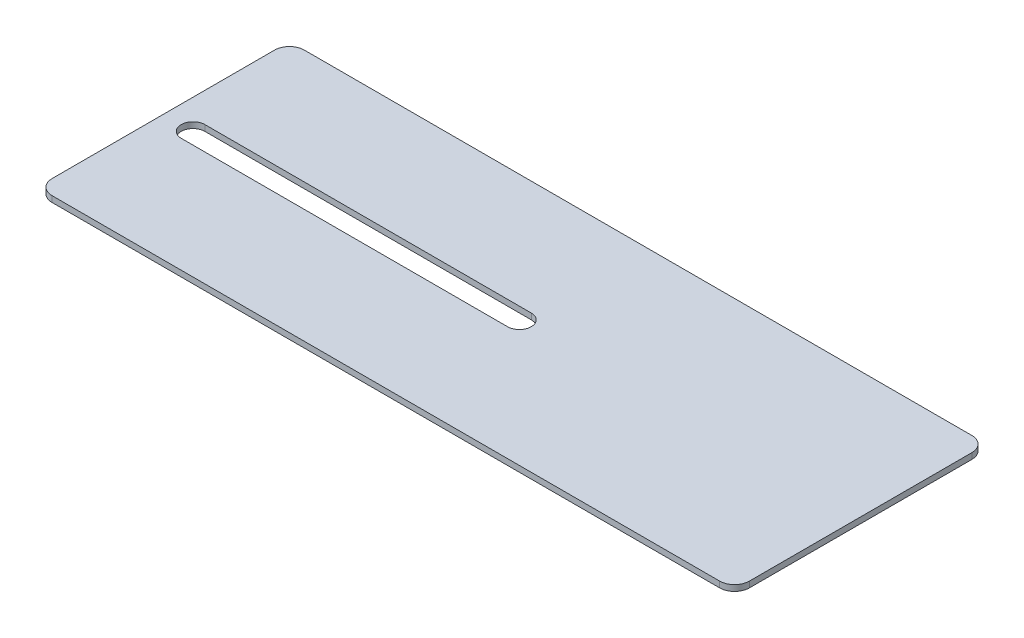
ISO-10303-21;
HEADER;
FILE_DESCRIPTION(('STEP AP214'),'2;1');
FILE_NAME('part.step','',(''),(''),'','','');
FILE_SCHEMA(('AUTOMOTIVE_DESIGN { 1 0 10303 214 1 1 1 1 }'));
ENDSEC;
DATA;
#1=APPLICATION_CONTEXT('core data for automotive mechanical design processes');
#2=APPLICATION_PROTOCOL_DEFINITION('international standard','automotive_design',2000,#1);
#3=PRODUCT_CONTEXT('',#1,'mechanical');
#4=PRODUCT('Part','Part','',(#3));
#5=PRODUCT_RELATED_PRODUCT_CATEGORY('part','',(#4));
#6=PRODUCT_DEFINITION_FORMATION('','',#4);
#7=PRODUCT_DEFINITION_CONTEXT('part definition',#1,'design');
#8=PRODUCT_DEFINITION('design','',#6,#7);
#9=PRODUCT_DEFINITION_SHAPE('','',#8);
#10=(LENGTH_UNIT() NAMED_UNIT(*) SI_UNIT(.MILLI.,.METRE.));
#11=(NAMED_UNIT(*) PLANE_ANGLE_UNIT() SI_UNIT($,.RADIAN.));
#12=(NAMED_UNIT(*) SI_UNIT($,.STERADIAN.) SOLID_ANGLE_UNIT());
#13=UNCERTAINTY_MEASURE_WITH_UNIT(LENGTH_MEASURE(1.E-05),#10,'distance_accuracy_value','');
#14=(GEOMETRIC_REPRESENTATION_CONTEXT(3) GLOBAL_UNCERTAINTY_ASSIGNED_CONTEXT((#13)) GLOBAL_UNIT_ASSIGNED_CONTEXT((#10,
#11,#12)) REPRESENTATION_CONTEXT('',''));
#15=CARTESIAN_POINT('',(0.,0.,0.));
#16=DIRECTION('',(0.,0.,1.));
#17=DIRECTION('',(1.,0.,0.));
#18=AXIS2_PLACEMENT_3D('',#15,#16,#17);
#19=CARTESIAN_POINT('',(117.5,0.,42.5));
#20=DIRECTION('',(1.,0.,0.));
#21=DIRECTION('',(0.,0.,-1.));
#22=AXIS2_PLACEMENT_3D('',#19,#20,#21);
#23=PLANE('',#22);
#24=DIRECTION('',(0.,1.,0.));
#25=VECTOR('',#24,1.);
#26=CARTESIAN_POINT('',(117.5,0.,37.5));
#27=LINE('',#26,#25);
#28=CARTESIAN_POINT('',(117.5,-2.,37.5));
#29=VERTEX_POINT('',#28);
#30=CARTESIAN_POINT('',(117.5,0.,37.5));
#31=VERTEX_POINT('',#30);
#32=EDGE_CURVE('E11',#29,#31,#27,.T.);
#33=ORIENTED_EDGE('',*,*,#32,.F.);
#34=DIRECTION('',(0.,0.,1.));
#35=VECTOR('',#34,1.);
#36=CARTESIAN_POINT('',(117.5,-2.,0.));
#37=LINE('',#36,#35);
#38=CARTESIAN_POINT('',(117.5,-2.,-37.5));
#39=VERTEX_POINT('',#38);
#40=EDGE_CURVE('E117',#29,#39,#37,.F.);
#41=ORIENTED_EDGE('',*,*,#40,.T.);
#42=DIRECTION('',(0.,1.,0.));
#43=VECTOR('',#42,1.);
#44=CARTESIAN_POINT('',(117.5,0.,-37.5));
#45=LINE('',#44,#43);
#46=CARTESIAN_POINT('',(117.5,0.,-37.5));
#47=VERTEX_POINT('',#46);
#48=EDGE_CURVE('E47',#39,#47,#45,.T.);
#49=ORIENTED_EDGE('',*,*,#48,.T.);
#50=DIRECTION('',(0.,0.,-1.));
#51=VECTOR('',#50,1.);
#52=CARTESIAN_POINT('',(117.5,0.,42.5));
#53=LINE('',#52,#51);
#54=EDGE_CURVE('E173',#31,#47,#53,.T.);
#55=ORIENTED_EDGE('',*,*,#54,.F.);
#56=EDGE_LOOP('',(#33,#41,#49,#55));
#57=FACE_BOUND('',#56,.T.);
#58=ADVANCED_FACE('F37',(#57),#23,.T.);
#59=CARTESIAN_POINT('',(112.5,0.,-37.5));
#60=DIRECTION('',(0.,1.,0.));
#61=DIRECTION('',(0.,0.,1.));
#62=AXIS2_PLACEMENT_3D('',#59,#60,#61);
#63=CYLINDRICAL_SURFACE('',#62,5.);
#64=ORIENTED_EDGE('',*,*,#48,.F.);
#65=CARTESIAN_POINT('',(112.5,-2.,-37.5));
#66=DIRECTION('',(0.,1.,0.));
#67=DIRECTION('',(0.,0.,1.));
#68=AXIS2_PLACEMENT_3D('',#65,#66,#67);
#69=CIRCLE('',#68,5.);
#70=CARTESIAN_POINT('',(112.5,-2.,-42.5));
#71=VERTEX_POINT('',#70);
#72=EDGE_CURVE('E141',#39,#71,#69,.T.);
#73=ORIENTED_EDGE('',*,*,#72,.T.);
#74=DIRECTION('',(0.,1.,0.));
#75=VECTOR('',#74,1.);
#76=CARTESIAN_POINT('',(112.5,0.,-42.5));
#77=LINE('',#76,#75);
#78=CARTESIAN_POINT('',(112.5,0.,-42.5));
#79=VERTEX_POINT('',#78);
#80=EDGE_CURVE('E166',#71,#79,#77,.T.);
#81=ORIENTED_EDGE('',*,*,#80,.T.);
#82=CARTESIAN_POINT('',(112.5,0.,-37.5));
#83=DIRECTION('',(0.,1.,0.));
#84=DIRECTION('',(0.,0.,1.));
#85=AXIS2_PLACEMENT_3D('',#82,#83,#84);
#86=CIRCLE('',#85,5.);
#87=EDGE_CURVE('E182',#47,#79,#86,.T.);
#88=ORIENTED_EDGE('',*,*,#87,.F.);
#89=EDGE_LOOP('',(#64,#73,#81,#88));
#90=FACE_BOUND('',#89,.T.);
#91=ADVANCED_FACE('F185',(#90),#63,.T.);
#92=CARTESIAN_POINT('',(117.5,0.,-42.5));
#93=DIRECTION('',(0.,0.,-1.));
#94=DIRECTION('',(-1.,0.,0.));
#95=AXIS2_PLACEMENT_3D('',#92,#93,#94);
#96=PLANE('',#95);
#97=ORIENTED_EDGE('',*,*,#80,.F.);
#98=DIRECTION('',(1.,0.,0.));
#99=VECTOR('',#98,1.);
#100=CARTESIAN_POINT('',(0.,-2.,-42.5));
#101=LINE('',#100,#99);
#102=CARTESIAN_POINT('',(-112.5,-2.,-42.5));
#103=VERTEX_POINT('',#102);
#104=EDGE_CURVE('E138',#71,#103,#101,.F.);
#105=ORIENTED_EDGE('',*,*,#104,.T.);
#106=DIRECTION('',(0.,1.,0.));
#107=VECTOR('',#106,1.);
#108=CARTESIAN_POINT('',(-112.5,0.,-42.5));
#109=LINE('',#108,#107);
#110=CARTESIAN_POINT('',(-112.5,0.,-42.5));
#111=VERTEX_POINT('',#110);
#112=EDGE_CURVE('E163',#103,#111,#109,.T.);
#113=ORIENTED_EDGE('',*,*,#112,.T.);
#114=DIRECTION('',(-1.,0.,0.));
#115=VECTOR('',#114,1.);
#116=CARTESIAN_POINT('',(117.5,0.,-42.5));
#117=LINE('',#116,#115);
#118=EDGE_CURVE('E186',#79,#111,#117,.T.);
#119=ORIENTED_EDGE('',*,*,#118,.F.);
#120=EDGE_LOOP('',(#97,#105,#113,#119));
#121=FACE_BOUND('',#120,.T.);
#122=ADVANCED_FACE('F269',(#121),#96,.T.);
#123=CARTESIAN_POINT('',(-112.5,0.,-37.5));
#124=DIRECTION('',(0.,1.,0.));
#125=DIRECTION('',(0.,0.,1.));
#126=AXIS2_PLACEMENT_3D('',#123,#124,#125);
#127=CYLINDRICAL_SURFACE('',#126,5.);
#128=ORIENTED_EDGE('',*,*,#112,.F.);
#129=CARTESIAN_POINT('',(-112.5,-2.,-37.5));
#130=DIRECTION('',(0.,1.,0.));
#131=DIRECTION('',(0.,0.,1.));
#132=AXIS2_PLACEMENT_3D('',#129,#130,#131);
#133=CIRCLE('',#132,5.);
#134=CARTESIAN_POINT('',(-117.5,-2.,-37.5));
#135=VERTEX_POINT('',#134);
#136=EDGE_CURVE('E135',#103,#135,#133,.T.);
#137=ORIENTED_EDGE('',*,*,#136,.T.);
#138=DIRECTION('',(0.,1.,0.));
#139=VECTOR('',#138,1.);
#140=CARTESIAN_POINT('',(-117.5,0.,-37.5));
#141=LINE('',#140,#139);
#142=CARTESIAN_POINT('',(-117.5,0.,-37.5));
#143=VERTEX_POINT('',#142);
#144=EDGE_CURVE('E160',#135,#143,#141,.T.);
#145=ORIENTED_EDGE('',*,*,#144,.T.);
#146=CARTESIAN_POINT('',(-112.5,0.,-37.5));
#147=DIRECTION('',(0.,1.,0.));
#148=DIRECTION('',(0.,0.,1.));
#149=AXIS2_PLACEMENT_3D('',#146,#147,#148);
#150=CIRCLE('',#149,5.);
#151=EDGE_CURVE('E188',#111,#143,#150,.T.);
#152=ORIENTED_EDGE('',*,*,#151,.F.);
#153=EDGE_LOOP('',(#128,#137,#145,#152));
#154=FACE_BOUND('',#153,.T.);
#155=ADVANCED_FACE('F231',(#154),#127,.T.);
#156=CARTESIAN_POINT('',(-117.5,0.,42.5));
#157=DIRECTION('',(-1.,0.,0.));
#158=DIRECTION('',(0.,0.,1.));
#159=AXIS2_PLACEMENT_3D('',#156,#157,#158);
#160=PLANE('',#159);
#161=ORIENTED_EDGE('',*,*,#144,.F.);
#162=DIRECTION('',(0.,0.,1.));
#163=VECTOR('',#162,1.);
#164=CARTESIAN_POINT('',(-117.5,-2.,0.));
#165=LINE('',#164,#163);
#166=CARTESIAN_POINT('',(-117.5,-2.,37.5));
#167=VERTEX_POINT('',#166);
#168=EDGE_CURVE('E132',#135,#167,#165,.T.);
#169=ORIENTED_EDGE('',*,*,#168,.T.);
#170=DIRECTION('',(0.,1.,0.));
#171=VECTOR('',#170,1.);
#172=CARTESIAN_POINT('',(-117.5,0.,37.5));
#173=LINE('',#172,#171);
#174=CARTESIAN_POINT('',(-117.5,0.,37.5));
#175=VERTEX_POINT('',#174);
#176=EDGE_CURVE('E158',#167,#175,#173,.T.);
#177=ORIENTED_EDGE('',*,*,#176,.T.);
#178=DIRECTION('',(0.,0.,1.));
#179=VECTOR('',#178,1.);
#180=CARTESIAN_POINT('',(-117.5,0.,42.5));
#181=LINE('',#180,#179);
#182=EDGE_CURVE('E194',#143,#175,#181,.T.);
#183=ORIENTED_EDGE('',*,*,#182,.F.);
#184=EDGE_LOOP('',(#161,#169,#177,#183));
#185=FACE_BOUND('',#184,.T.);
#186=ADVANCED_FACE('F236',(#185),#160,.T.);
#187=CARTESIAN_POINT('',(-112.5,0.,37.5));
#188=DIRECTION('',(0.,1.,0.));
#189=DIRECTION('',(0.,0.,1.));
#190=AXIS2_PLACEMENT_3D('',#187,#188,#189);
#191=CYLINDRICAL_SURFACE('',#190,5.);
#192=ORIENTED_EDGE('',*,*,#176,.F.);
#193=CARTESIAN_POINT('',(-112.5,-2.,37.5));
#194=DIRECTION('',(0.,1.,0.));
#195=DIRECTION('',(0.,0.,1.));
#196=AXIS2_PLACEMENT_3D('',#193,#194,#195);
#197=CIRCLE('',#196,5.);
#198=CARTESIAN_POINT('',(-112.5,-2.,42.5));
#199=VERTEX_POINT('',#198);
#200=EDGE_CURVE('E129',#167,#199,#197,.T.);
#201=ORIENTED_EDGE('',*,*,#200,.T.);
#202=DIRECTION('',(0.,1.,0.));
#203=VECTOR('',#202,1.);
#204=CARTESIAN_POINT('',(-112.5,0.,42.5));
#205=LINE('',#204,#203);
#206=CARTESIAN_POINT('',(-112.5,0.,42.5));
#207=VERTEX_POINT('',#206);
#208=EDGE_CURVE('E55',#199,#207,#205,.T.);
#209=ORIENTED_EDGE('',*,*,#208,.T.);
#210=CARTESIAN_POINT('',(-112.5,0.,37.5));
#211=DIRECTION('',(0.,1.,0.));
#212=DIRECTION('',(0.,0.,1.));
#213=AXIS2_PLACEMENT_3D('',#210,#211,#212);
#214=CIRCLE('',#213,5.);
#215=EDGE_CURVE('E156',#175,#207,#214,.T.);
#216=ORIENTED_EDGE('',*,*,#215,.F.);
#217=EDGE_LOOP('',(#192,#201,#209,#216));
#218=FACE_BOUND('',#217,.T.);
#219=ADVANCED_FACE('F237',(#218),#191,.T.);
#220=CARTESIAN_POINT('',(117.5,0.,42.5));
#221=DIRECTION('',(0.,0.,1.));
#222=DIRECTION('',(1.,0.,0.));
#223=AXIS2_PLACEMENT_3D('',#220,#221,#222);
#224=PLANE('',#223);
#225=ORIENTED_EDGE('',*,*,#208,.F.);
#226=DIRECTION('',(1.,0.,0.));
#227=VECTOR('',#226,1.);
#228=CARTESIAN_POINT('',(0.,-2.,42.5));
#229=LINE('',#228,#227);
#230=CARTESIAN_POINT('',(112.5,-2.,42.5));
#231=VERTEX_POINT('',#230);
#232=EDGE_CURVE('E115',#199,#231,#229,.T.);
#233=ORIENTED_EDGE('',*,*,#232,.T.);
#234=DIRECTION('',(0.,1.,0.));
#235=VECTOR('',#234,1.);
#236=CARTESIAN_POINT('',(112.5,0.,42.5));
#237=LINE('',#236,#235);
#238=CARTESIAN_POINT('',(112.5,0.,42.5));
#239=VERTEX_POINT('',#238);
#240=EDGE_CURVE('E41',#231,#239,#237,.T.);
#241=ORIENTED_EDGE('',*,*,#240,.T.);
#242=DIRECTION('',(1.,0.,0.));
#243=VECTOR('',#242,1.);
#244=CARTESIAN_POINT('',(117.5,0.,42.5));
#245=LINE('',#244,#243);
#246=EDGE_CURVE('E238',#207,#239,#245,.T.);
#247=ORIENTED_EDGE('',*,*,#246,.F.);
#248=EDGE_LOOP('',(#225,#233,#241,#247));
#249=FACE_BOUND('',#248,.T.);
#250=ADVANCED_FACE('F119',(#249),#224,.T.);
#251=CARTESIAN_POINT('',(2.49999999999989,0.,0.));
#252=DIRECTION('',(0.,1.,0.));
#253=DIRECTION('',(0.,0.,1.));
#254=AXIS2_PLACEMENT_3D('',#251,#252,#253);
#255=CYLINDRICAL_SURFACE('',#254,4.);
#256=DIRECTION('',(0.,1.,0.));
#257=VECTOR('',#256,1.);
#258=CARTESIAN_POINT('',(2.49999999999989,0.,-4.));
#259=LINE('',#258,#257);
#260=CARTESIAN_POINT('',(2.49999999999989,-2.,-4.));
#261=VERTEX_POINT('',#260);
#262=CARTESIAN_POINT('',(2.49999999999989,0.,-4.));
#263=VERTEX_POINT('',#262);
#264=EDGE_CURVE('E110',#261,#263,#259,.T.);
#265=ORIENTED_EDGE('',*,*,#264,.F.);
#266=CARTESIAN_POINT('',(2.49999999999989,-2.,0.));
#267=DIRECTION('',(0.,1.,0.));
#268=DIRECTION('',(0.,0.,1.));
#269=AXIS2_PLACEMENT_3D('',#266,#267,#268);
#270=CIRCLE('',#269,4.);
#271=CARTESIAN_POINT('',(2.49999999999989,-2.,4.));
#272=VERTEX_POINT('',#271);
#273=EDGE_CURVE('E123',#272,#261,#270,.T.);
#274=ORIENTED_EDGE('',*,*,#273,.F.);
#275=DIRECTION('',(0.,1.,0.));
#276=VECTOR('',#275,1.);
#277=CARTESIAN_POINT('',(2.49999999999989,0.,4.));
#278=LINE('',#277,#276);
#279=CARTESIAN_POINT('',(2.49999999999989,0.,4.));
#280=VERTEX_POINT('',#279);
#281=EDGE_CURVE('E148',#272,#280,#278,.T.);
#282=ORIENTED_EDGE('',*,*,#281,.T.);
#283=CARTESIAN_POINT('',(2.49999999999989,0.,0.));
#284=DIRECTION('',(0.,1.,0.));
#285=DIRECTION('',(0.,0.,1.));
#286=AXIS2_PLACEMENT_3D('',#283,#284,#285);
#287=CIRCLE('',#286,4.);
#288=EDGE_CURVE('E240',#280,#263,#287,.T.);
#289=ORIENTED_EDGE('',*,*,#288,.T.);
#290=EDGE_LOOP('',(#265,#274,#282,#289));
#291=FACE_BOUND('',#290,.T.);
#292=ADVANCED_FACE('F254',(#291),#255,.F.);
#293=CARTESIAN_POINT('',(-107.5,0.,4.));
#294=DIRECTION('',(0.,0.,1.));
#295=DIRECTION('',(1.,0.,0.));
#296=AXIS2_PLACEMENT_3D('',#293,#294,#295);
#297=PLANE('',#296);
#298=ORIENTED_EDGE('',*,*,#281,.F.);
#299=DIRECTION('',(1.,0.,0.));
#300=VECTOR('',#299,1.);
#301=CARTESIAN_POINT('',(0.,-2.,4.));
#302=LINE('',#301,#300);
#303=CARTESIAN_POINT('',(-107.5,-2.,4.));
#304=VERTEX_POINT('',#303);
#305=EDGE_CURVE('E120',#304,#272,#302,.T.);
#306=ORIENTED_EDGE('',*,*,#305,.F.);
#307=DIRECTION('',(0.,1.,0.));
#308=VECTOR('',#307,1.);
#309=CARTESIAN_POINT('',(-107.5,0.,4.));
#310=LINE('',#309,#308);
#311=CARTESIAN_POINT('',(-107.5,0.,4.));
#312=VERTEX_POINT('',#311);
#313=EDGE_CURVE('E145',#304,#312,#310,.T.);
#314=ORIENTED_EDGE('',*,*,#313,.T.);
#315=DIRECTION('',(1.,0.,0.));
#316=VECTOR('',#315,1.);
#317=CARTESIAN_POINT('',(-107.5,0.,4.));
#318=LINE('',#317,#316);
#319=EDGE_CURVE('E219',#312,#280,#318,.T.);
#320=ORIENTED_EDGE('',*,*,#319,.T.);
#321=EDGE_LOOP('',(#298,#306,#314,#320));
#322=FACE_BOUND('',#321,.T.);
#323=ADVANCED_FACE('F217',(#322),#297,.F.);
#324=CARTESIAN_POINT('',(-107.5,0.,0.));
#325=DIRECTION('',(0.,1.,0.));
#326=DIRECTION('',(0.,0.,1.));
#327=AXIS2_PLACEMENT_3D('',#324,#325,#326);
#328=CYLINDRICAL_SURFACE('',#327,4.);
#329=ORIENTED_EDGE('',*,*,#313,.F.);
#330=CARTESIAN_POINT('',(-107.5,-2.,0.));
#331=DIRECTION('',(0.,1.,0.));
#332=DIRECTION('',(0.,0.,1.));
#333=AXIS2_PLACEMENT_3D('',#330,#331,#332);
#334=CIRCLE('',#333,4.);
#335=CARTESIAN_POINT('',(-107.5,-2.,-4.));
#336=VERTEX_POINT('',#335);
#337=EDGE_CURVE('E199',#336,#304,#334,.T.);
#338=ORIENTED_EDGE('',*,*,#337,.F.);
#339=DIRECTION('',(0.,1.,0.));
#340=VECTOR('',#339,1.);
#341=CARTESIAN_POINT('',(-107.5,0.,-4.));
#342=LINE('',#341,#340);
#343=CARTESIAN_POINT('',(-107.5,0.,-4.));
#344=VERTEX_POINT('',#343);
#345=EDGE_CURVE('E149',#336,#344,#342,.T.);
#346=ORIENTED_EDGE('',*,*,#345,.T.);
#347=CARTESIAN_POINT('',(-107.5,0.,0.));
#348=DIRECTION('',(0.,1.,0.));
#349=DIRECTION('',(0.,0.,1.));
#350=AXIS2_PLACEMENT_3D('',#347,#348,#349);
#351=CIRCLE('',#350,4.);
#352=EDGE_CURVE('E131',#344,#312,#351,.T.);
#353=ORIENTED_EDGE('',*,*,#352,.T.);
#354=EDGE_LOOP('',(#329,#338,#346,#353));
#355=FACE_BOUND('',#354,.T.);
#356=ADVANCED_FACE('F210',(#355),#328,.F.);
#357=CARTESIAN_POINT('',(-107.5,0.,-4.));
#358=DIRECTION('',(0.,0.,-1.));
#359=DIRECTION('',(-1.,0.,0.));
#360=AXIS2_PLACEMENT_3D('',#357,#358,#359);
#361=PLANE('',#360);
#362=DIRECTION('',(1.,0.,0.));
#363=VECTOR('',#362,1.);
#364=CARTESIAN_POINT('',(0.,-2.,-4.));
#365=LINE('',#364,#363);
#366=EDGE_CURVE('E127',#261,#336,#365,.F.);
#367=ORIENTED_EDGE('',*,*,#366,.F.);
#368=ORIENTED_EDGE('',*,*,#264,.T.);
#369=DIRECTION('',(-1.,0.,0.));
#370=VECTOR('',#369,1.);
#371=CARTESIAN_POINT('',(-107.5,0.,-4.));
#372=LINE('',#371,#370);
#373=EDGE_CURVE('E245',#263,#344,#372,.T.);
#374=ORIENTED_EDGE('',*,*,#373,.T.);
#375=ORIENTED_EDGE('',*,*,#345,.F.);
#376=EDGE_LOOP('',(#367,#368,#374,#375));
#377=FACE_BOUND('',#376,.T.);
#378=ADVANCED_FACE('F249',(#377),#361,.F.);
#379=CARTESIAN_POINT('',(112.5,0.,37.5));
#380=DIRECTION('',(0.,1.,0.));
#381=DIRECTION('',(0.,0.,1.));
#382=AXIS2_PLACEMENT_3D('',#379,#380,#381);
#383=CYLINDRICAL_SURFACE('',#382,5.);
#384=CARTESIAN_POINT('',(112.5,-2.,37.5));
#385=DIRECTION('',(0.,1.,0.));
#386=DIRECTION('',(0.,0.,1.));
#387=AXIS2_PLACEMENT_3D('',#384,#385,#386);
#388=CIRCLE('',#387,5.);
#389=EDGE_CURVE('E103',#231,#29,#388,.T.);
#390=ORIENTED_EDGE('',*,*,#389,.T.);
#391=ORIENTED_EDGE('',*,*,#32,.T.);
#392=CARTESIAN_POINT('',(112.5,0.,37.5));
#393=DIRECTION('',(0.,1.,0.));
#394=DIRECTION('',(0.,0.,1.));
#395=AXIS2_PLACEMENT_3D('',#392,#393,#394);
#396=CIRCLE('',#395,5.);
#397=EDGE_CURVE('E106',#239,#31,#396,.T.);
#398=ORIENTED_EDGE('',*,*,#397,.F.);
#399=ORIENTED_EDGE('',*,*,#240,.F.);
#400=EDGE_LOOP('',(#390,#391,#398,#399));
#401=FACE_BOUND('',#400,.T.);
#402=ADVANCED_FACE('F39',(#401),#383,.T.);
#403=CARTESIAN_POINT('',(0.,0.,0.));
#404=DIRECTION('',(0.,1.,0.));
#405=DIRECTION('',(0.,0.,1.));
#406=AXIS2_PLACEMENT_3D('',#403,#404,#405);
#407=PLANE('',#406);
#408=ORIENTED_EDGE('',*,*,#352,.F.);
#409=ORIENTED_EDGE('',*,*,#373,.F.);
#410=ORIENTED_EDGE('',*,*,#288,.F.);
#411=ORIENTED_EDGE('',*,*,#319,.F.);
#412=EDGE_LOOP('',(#408,#409,#410,#411));
#413=FACE_BOUND('',#412,.T.);
#414=ORIENTED_EDGE('',*,*,#246,.T.);
#415=ORIENTED_EDGE('',*,*,#397,.T.);
#416=ORIENTED_EDGE('',*,*,#54,.T.);
#417=ORIENTED_EDGE('',*,*,#87,.T.);
#418=ORIENTED_EDGE('',*,*,#118,.T.);
#419=ORIENTED_EDGE('',*,*,#151,.T.);
#420=ORIENTED_EDGE('',*,*,#182,.T.);
#421=ORIENTED_EDGE('',*,*,#215,.T.);
#422=EDGE_LOOP('',(#414,#415,#416,#417,#418,#419,#420,#421));
#423=FACE_BOUND('',#422,.T.);
#424=ADVANCED_FACE('F180',(#413,#423),#407,.T.);
#425=CARTESIAN_POINT('',(0.,-2.,0.));
#426=DIRECTION('',(0.,1.,0.));
#427=DIRECTION('',(0.,0.,1.));
#428=AXIS2_PLACEMENT_3D('',#425,#426,#427);
#429=PLANE('',#428);
#430=ORIENTED_EDGE('',*,*,#337,.T.);
#431=ORIENTED_EDGE('',*,*,#305,.T.);
#432=ORIENTED_EDGE('',*,*,#273,.T.);
#433=ORIENTED_EDGE('',*,*,#366,.T.);
#434=EDGE_LOOP('',(#430,#431,#432,#433));
#435=FACE_BOUND('',#434,.T.);
#436=ORIENTED_EDGE('',*,*,#232,.F.);
#437=ORIENTED_EDGE('',*,*,#200,.F.);
#438=ORIENTED_EDGE('',*,*,#168,.F.);
#439=ORIENTED_EDGE('',*,*,#136,.F.);
#440=ORIENTED_EDGE('',*,*,#104,.F.);
#441=ORIENTED_EDGE('',*,*,#72,.F.);
#442=ORIENTED_EDGE('',*,*,#40,.F.);
#443=ORIENTED_EDGE('',*,*,#389,.F.);
#444=EDGE_LOOP('',(#436,#437,#438,#439,#440,#441,#442,#443));
#445=FACE_BOUND('',#444,.T.);
#446=ADVANCED_FACE('F113',(#435,#445),#429,.F.);
#447=CLOSED_SHELL('',(#58,#91,#122,#155,#186,#219,#250,#292,#323,#356,#378,#402,#424,#446));
#448=MANIFOLD_SOLID_BREP('B2',#447);
#449=ADVANCED_BREP_SHAPE_REPRESENTATION('',(#18,#448),#14);
#450=SHAPE_DEFINITION_REPRESENTATION(#9,#449);
ENDSEC;
END-ISO-10303-21;
